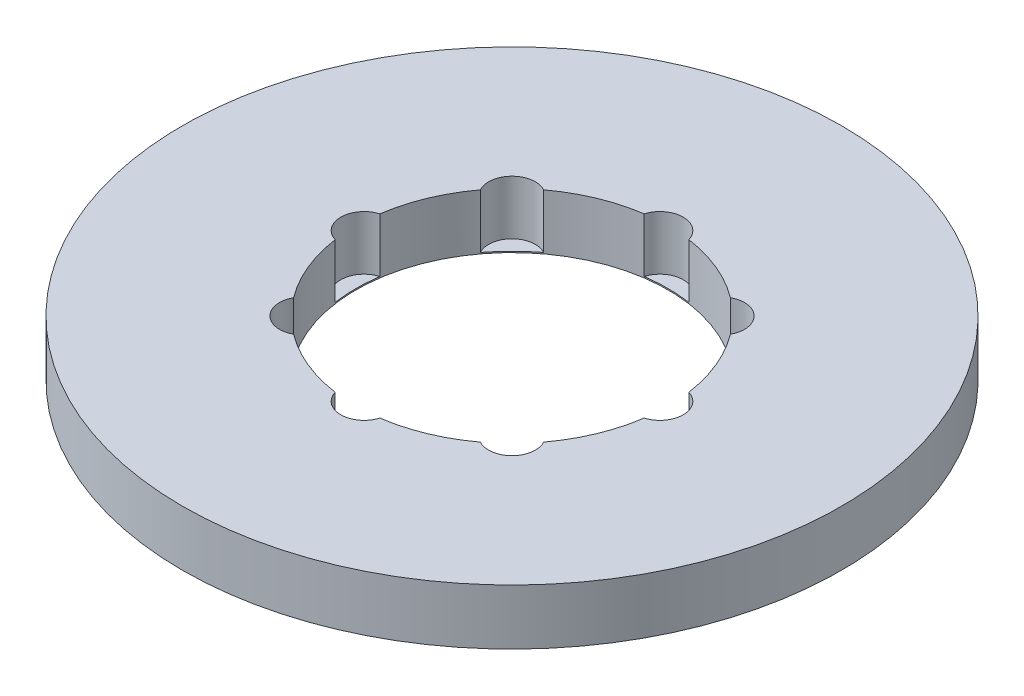
ISO-10303-21;
HEADER;
FILE_DESCRIPTION(('STEP AP214'),'2;1');
FILE_NAME('part.step','',(''),(''),'','','');
FILE_SCHEMA(('AUTOMOTIVE_DESIGN { 1 0 10303 214 1 1 1 1 }'));
ENDSEC;
DATA;
#1=APPLICATION_CONTEXT('core data for automotive mechanical design processes');
#2=APPLICATION_PROTOCOL_DEFINITION('international standard','automotive_design',2000,#1);
#3=PRODUCT_CONTEXT('',#1,'mechanical');
#4=PRODUCT('Part','Part','',(#3));
#5=PRODUCT_RELATED_PRODUCT_CATEGORY('part','',(#4));
#6=PRODUCT_DEFINITION_FORMATION('','',#4);
#7=PRODUCT_DEFINITION_CONTEXT('part definition',#1,'design');
#8=PRODUCT_DEFINITION('design','',#6,#7);
#9=PRODUCT_DEFINITION_SHAPE('','',#8);
#10=(LENGTH_UNIT() NAMED_UNIT(*) SI_UNIT(.MILLI.,.METRE.));
#11=(NAMED_UNIT(*) PLANE_ANGLE_UNIT() SI_UNIT($,.RADIAN.));
#12=(NAMED_UNIT(*) SI_UNIT($,.STERADIAN.) SOLID_ANGLE_UNIT());
#13=UNCERTAINTY_MEASURE_WITH_UNIT(LENGTH_MEASURE(1.E-05),#10,'distance_accuracy_value','');
#14=(GEOMETRIC_REPRESENTATION_CONTEXT(3) GLOBAL_UNCERTAINTY_ASSIGNED_CONTEXT((#13)) GLOBAL_UNIT_ASSIGNED_CONTEXT((#10,
#11,#12)) REPRESENTATION_CONTEXT('',''));
#15=CARTESIAN_POINT('',(0.,0.,0.));
#16=DIRECTION('',(0.,0.,1.));
#17=DIRECTION('',(1.,0.,0.));
#18=AXIS2_PLACEMENT_3D('',#15,#16,#17);
#19=CARTESIAN_POINT('',(0.,16.,0.));
#20=DIRECTION('',(0.,-1.,0.));
#21=DIRECTION('',(0.,0.,-1.));
#22=AXIS2_PLACEMENT_3D('',#19,#20,#21);
#23=CYLINDRICAL_SURFACE('',#22,95.);
#24=CARTESIAN_POINT('',(0.,16.,0.));
#25=DIRECTION('',(0.,1.,0.));
#26=DIRECTION('',(0.,0.,1.));
#27=AXIS2_PLACEMENT_3D('',#24,#25,#26);
#28=CIRCLE('',#27,95.);
#29=CARTESIAN_POINT('',(0.,16.,95.));
#30=VERTEX_POINT('',#29);
#31=EDGE_CURVE('E183',#30,#30,#28,.T.);
#32=ORIENTED_EDGE('',*,*,#31,.F.);
#33=EDGE_LOOP('',(#32));
#34=FACE_BOUND('',#33,.T.);
#35=CARTESIAN_POINT('',(0.,0.,0.));
#36=DIRECTION('',(0.,1.,0.));
#37=DIRECTION('',(0.,0.,1.));
#38=AXIS2_PLACEMENT_3D('',#35,#36,#37);
#39=CIRCLE('',#38,95.);
#40=CARTESIAN_POINT('',(0.,0.,95.));
#41=VERTEX_POINT('',#40);
#42=EDGE_CURVE('E182',#41,#41,#39,.T.);
#43=ORIENTED_EDGE('',*,*,#42,.T.);
#44=EDGE_LOOP('',(#43));
#45=FACE_BOUND('',#44,.T.);
#46=ADVANCED_FACE('F39',(#34,#45),#23,.T.);
#47=CARTESIAN_POINT('',(0.,16.,0.));
#48=DIRECTION('',(0.,1.,0.));
#49=DIRECTION('',(0.,0.,1.));
#50=AXIS2_PLACEMENT_3D('',#47,#48,#49);
#51=PLANE('',#50);
#52=CARTESIAN_POINT('',(1.48870215639707E-13,16.,42.638124392506));
#53=DIRECTION('',(0.,1.,0.));
#54=DIRECTION('',(1.,0.,0.));
#55=AXIS2_PLACEMENT_3D('',#52,#53,#54);
#56=CIRCLE('',#55,6.71547705988087);
#57=CARTESIAN_POINT('',(-6.44154630315603,16.,44.536574646287));
#58=VERTEX_POINT('',#57);
#59=CARTESIAN_POINT('',(6.44154630315634,16.,44.536574646287));
#60=VERTEX_POINT('',#59);
#61=EDGE_CURVE('E256',#58,#60,#56,.T.);
#62=ORIENTED_EDGE('',*,*,#61,.F.);
#63=CARTESIAN_POINT('',(0.,16.,0.));
#64=DIRECTION('',(0.,1.,0.));
#65=DIRECTION('',(0.,0.,1.));
#66=AXIS2_PLACEMENT_3D('',#63,#64,#65);
#67=CIRCLE('',#66,45.);
#68=CARTESIAN_POINT('',(-26.9372528709215,16.,36.0469750154993));
#69=VERTEX_POINT('',#68);
#70=EDGE_CURVE('E175',#69,#58,#67,.T.);
#71=ORIENTED_EDGE('',*,*,#70,.F.);
#72=CARTESIAN_POINT('',(-30.1497068950165,16.,30.1497068950166));
#73=DIRECTION('',(0.,1.,0.));
#74=DIRECTION('',(0.707106781186549,0.,0.707106781186546));
#75=AXIS2_PLACEMENT_3D('',#72,#73,#74);
#76=CIRCLE('',#75,6.71547705988087);
#77=CARTESIAN_POINT('',(-36.0469750154992,16.,26.9372528709216));
#78=VERTEX_POINT('',#77);
#79=EDGE_CURVE('E152',#78,#69,#76,.T.);
#80=ORIENTED_EDGE('',*,*,#79,.F.);
#81=CARTESIAN_POINT('',(-44.536574646287,16.,6.44154630315619));
#82=VERTEX_POINT('',#81);
#83=EDGE_CURVE('E168',#82,#78,#67,.T.);
#84=ORIENTED_EDGE('',*,*,#83,.F.);
#85=CARTESIAN_POINT('',(-42.638124392506,16.,0.));
#86=DIRECTION('',(0.,1.,0.));
#87=DIRECTION('',(0.,0.,1.));
#88=AXIS2_PLACEMENT_3D('',#85,#86,#87);
#89=CIRCLE('',#88,6.71547705988087);
#90=CARTESIAN_POINT('',(-44.536574646287,16.,-6.44154630315619));
#91=VERTEX_POINT('',#90);
#92=EDGE_CURVE('E205',#91,#82,#89,.T.);
#93=ORIENTED_EDGE('',*,*,#92,.F.);
#94=CARTESIAN_POINT('',(-36.0469750154996,16.,-26.9372528709211));
#95=VERTEX_POINT('',#94);
#96=EDGE_CURVE('E181',#95,#91,#67,.T.);
#97=ORIENTED_EDGE('',*,*,#96,.F.);
#98=CARTESIAN_POINT('',(-30.1497068950169,16.,-30.1497068950162));
#99=DIRECTION('',(0.,1.,0.));
#100=DIRECTION('',(-0.707106781186539,0.,0.707106781186556));
#101=AXIS2_PLACEMENT_3D('',#98,#99,#100);
#102=CIRCLE('',#101,6.71547705988087);
#103=CARTESIAN_POINT('',(-26.937252870922,16.,-36.046975015499));
#104=VERTEX_POINT('',#103);
#105=EDGE_CURVE('E453',#104,#95,#102,.T.);
#106=ORIENTED_EDGE('',*,*,#105,.F.);
#107=CARTESIAN_POINT('',(-6.44154630315666,16.,-44.536574646287));
#108=VERTEX_POINT('',#107);
#109=EDGE_CURVE('E189',#108,#104,#67,.T.);
#110=ORIENTED_EDGE('',*,*,#109,.F.);
#111=CARTESIAN_POINT('',(-4.46610646919121E-13,16.,-42.638124392506));
#112=DIRECTION('',(0.,1.,0.));
#113=DIRECTION('',(-1.,0.,0.));
#114=AXIS2_PLACEMENT_3D('',#111,#112,#113);
#115=CIRCLE('',#114,6.71547705988087);
#116=CARTESIAN_POINT('',(6.44154630315572,16.,-44.5365746462871));
#117=VERTEX_POINT('',#116);
#118=EDGE_CURVE('E462',#117,#108,#115,.T.);
#119=ORIENTED_EDGE('',*,*,#118,.F.);
#120=CARTESIAN_POINT('',(26.9372528709212,16.,-36.0469750154995));
#121=VERTEX_POINT('',#120);
#122=EDGE_CURVE('E197',#121,#117,#67,.T.);
#123=ORIENTED_EDGE('',*,*,#122,.F.);
#124=CARTESIAN_POINT('',(30.1497068950163,16.,-30.1497068950168));
#125=DIRECTION('',(0.,1.,0.));
#126=DIRECTION('',(-0.707106781186554,0.,-0.707106781186541));
#127=AXIS2_PLACEMENT_3D('',#124,#125,#126);
#128=CIRCLE('',#127,6.71547705988087);
#129=CARTESIAN_POINT('',(36.0469750154991,16.,-26.9372528709218));
#130=VERTEX_POINT('',#129);
#131=EDGE_CURVE('E470',#130,#121,#128,.T.);
#132=ORIENTED_EDGE('',*,*,#131,.F.);
#133=CARTESIAN_POINT('',(44.536574646287,16.,-6.44154630315619));
#134=VERTEX_POINT('',#133);
#135=EDGE_CURVE('E489',#134,#130,#67,.T.);
#136=ORIENTED_EDGE('',*,*,#135,.F.);
#137=CARTESIAN_POINT('',(42.638124392506,16.,0.));
#138=DIRECTION('',(0.,1.,0.));
#139=DIRECTION('',(0.,0.,-1.));
#140=AXIS2_PLACEMENT_3D('',#137,#138,#139);
#141=CIRCLE('',#140,6.71547705988087);
#142=CARTESIAN_POINT('',(44.536574646287,16.,6.44154630315619));
#143=VERTEX_POINT('',#142);
#144=EDGE_CURVE('E476',#143,#134,#141,.T.);
#145=ORIENTED_EDGE('',*,*,#144,.F.);
#146=CARTESIAN_POINT('',(36.0469750154994,16.,26.9372528709214));
#147=VERTEX_POINT('',#146);
#148=EDGE_CURVE('E491',#147,#143,#67,.T.);
#149=ORIENTED_EDGE('',*,*,#148,.F.);
#150=CARTESIAN_POINT('',(30.1497068950167,16.,30.1497068950164));
#151=DIRECTION('',(0.,1.,0.));
#152=DIRECTION('',(0.707106781186544,0.,-0.707106781186551));
#153=AXIS2_PLACEMENT_3D('',#150,#151,#152);
#154=CIRCLE('',#153,6.71547705988087);
#155=CARTESIAN_POINT('',(26.9372528709217,16.,36.0469750154992));
#156=VERTEX_POINT('',#155);
#157=EDGE_CURVE('E475',#156,#147,#154,.T.);
#158=ORIENTED_EDGE('',*,*,#157,.F.);
#159=EDGE_CURVE('E190',#60,#156,#67,.T.);
#160=ORIENTED_EDGE('',*,*,#159,.F.);
#161=EDGE_LOOP('',(#62,#71,#80,#84,#93,#97,#106,#110,#119,#123,#132,#136,#145,#149,#158,#160));
#162=FACE_BOUND('',#161,.T.);
#163=ORIENTED_EDGE('',*,*,#31,.T.);
#164=EDGE_LOOP('',(#163));
#165=FACE_BOUND('',#164,.T.);
#166=ADVANCED_FACE('F170',(#162,#165),#51,.T.);
#167=CARTESIAN_POINT('',(0.,0.,0.));
#168=DIRECTION('',(0.,1.,0.));
#169=DIRECTION('',(0.,0.,1.));
#170=AXIS2_PLACEMENT_3D('',#167,#168,#169);
#171=PLANE('',#170);
#172=CARTESIAN_POINT('',(0.,0.,0.));
#173=DIRECTION('',(0.,1.,0.));
#174=DIRECTION('',(0.,0.,1.));
#175=AXIS2_PLACEMENT_3D('',#172,#173,#174);
#176=CIRCLE('',#175,45.);
#177=CARTESIAN_POINT('',(0.,0.,45.));
#178=VERTEX_POINT('',#177);
#179=EDGE_CURVE('E191',#178,#178,#176,.T.);
#180=ORIENTED_EDGE('',*,*,#179,.T.);
#181=EDGE_LOOP('',(#180));
#182=FACE_BOUND('',#181,.T.);
#183=ORIENTED_EDGE('',*,*,#42,.F.);
#184=EDGE_LOOP('',(#183));
#185=FACE_BOUND('',#184,.T.);
#186=ADVANCED_FACE('F277',(#182,#185),#171,.F.);
#187=CARTESIAN_POINT('',(0.,16.,0.));
#188=DIRECTION('',(0.,-1.,0.));
#189=DIRECTION('',(0.,0.,-1.));
#190=AXIS2_PLACEMENT_3D('',#187,#188,#189);
#191=CYLINDRICAL_SURFACE('',#190,45.);
#192=DIRECTION('',(0.,1.,0.));
#193=VECTOR('',#192,1.);
#194=CARTESIAN_POINT('',(-6.44154630315603,8.18353095102684,44.5365746462871));
#195=LINE('',#194,#193);
#196=CARTESIAN_POINT('',(-6.44154630315603,0.36706190205368,44.536574646287));
#197=VERTEX_POINT('',#196);
#198=EDGE_CURVE('E11',#197,#58,#195,.T.);
#199=ORIENTED_EDGE('',*,*,#198,.F.);
#200=CARTESIAN_POINT('',(0.,0.36706190205368,0.));
#201=DIRECTION('',(0.,1.,0.));
#202=DIRECTION('',(0.,0.,1.));
#203=AXIS2_PLACEMENT_3D('',#200,#201,#202);
#204=CIRCLE('',#203,45.);
#205=CARTESIAN_POINT('',(6.44154630315634,0.36706190205368,44.536574646287));
#206=VERTEX_POINT('',#205);
#207=EDGE_CURVE('E251',#197,#206,#204,.T.);
#208=ORIENTED_EDGE('',*,*,#207,.T.);
#209=DIRECTION('',(0.,1.,0.));
#210=VECTOR('',#209,1.);
#211=CARTESIAN_POINT('',(6.44154630315634,8.18353095102684,44.536574646287));
#212=LINE('',#211,#210);
#213=EDGE_CURVE('E46',#60,#206,#212,.F.);
#214=ORIENTED_EDGE('',*,*,#213,.F.);
#215=ORIENTED_EDGE('',*,*,#159,.T.);
#216=DIRECTION('',(0.,1.,0.));
#217=VECTOR('',#216,1.);
#218=CARTESIAN_POINT('',(26.9372528709217,8.18353095102684,36.0469750154992));
#219=LINE('',#218,#217);
#220=CARTESIAN_POINT('',(26.9372528709217,0.36706190205368,36.0469750154992));
#221=VERTEX_POINT('',#220);
#222=EDGE_CURVE('E253',#221,#156,#219,.T.);
#223=ORIENTED_EDGE('',*,*,#222,.F.);
#224=CARTESIAN_POINT('',(0.,0.36706190205368,0.));
#225=DIRECTION('',(0.,1.,0.));
#226=DIRECTION('',(0.,0.,1.));
#227=AXIS2_PLACEMENT_3D('',#224,#225,#226);
#228=CIRCLE('',#227,45.);
#229=CARTESIAN_POINT('',(36.0469750154994,0.36706190205368,26.9372528709214));
#230=VERTEX_POINT('',#229);
#231=EDGE_CURVE('E246',#221,#230,#228,.T.);
#232=ORIENTED_EDGE('',*,*,#231,.T.);
#233=DIRECTION('',(0.,1.,0.));
#234=VECTOR('',#233,1.);
#235=CARTESIAN_POINT('',(36.0469750154994,8.18353095102684,26.9372528709214));
#236=LINE('',#235,#234);
#237=EDGE_CURVE('E248',#147,#230,#236,.F.);
#238=ORIENTED_EDGE('',*,*,#237,.F.);
#239=ORIENTED_EDGE('',*,*,#148,.T.);
#240=DIRECTION('',(0.,1.,0.));
#241=VECTOR('',#240,1.);
#242=CARTESIAN_POINT('',(44.536574646287,8.18353095102684,6.44154630315619));
#243=LINE('',#242,#241);
#244=CARTESIAN_POINT('',(44.536574646287,0.36706190205368,6.44154630315619));
#245=VERTEX_POINT('',#244);
#246=EDGE_CURVE('E243',#245,#143,#243,.T.);
#247=ORIENTED_EDGE('',*,*,#246,.F.);
#248=CARTESIAN_POINT('',(0.,0.36706190205368,0.));
#249=DIRECTION('',(0.,1.,0.));
#250=DIRECTION('',(0.,0.,1.));
#251=AXIS2_PLACEMENT_3D('',#248,#249,#250);
#252=CIRCLE('',#251,45.);
#253=CARTESIAN_POINT('',(44.536574646287,0.36706190205368,-6.44154630315619));
#254=VERTEX_POINT('',#253);
#255=EDGE_CURVE('E236',#245,#254,#252,.T.);
#256=ORIENTED_EDGE('',*,*,#255,.T.);
#257=DIRECTION('',(0.,1.,0.));
#258=VECTOR('',#257,1.);
#259=CARTESIAN_POINT('',(44.536574646287,8.18353095102684,-6.44154630315619));
#260=LINE('',#259,#258);
#261=EDGE_CURVE('E241',#134,#254,#260,.F.);
#262=ORIENTED_EDGE('',*,*,#261,.F.);
#263=ORIENTED_EDGE('',*,*,#135,.T.);
#264=DIRECTION('',(0.,1.,0.));
#265=VECTOR('',#264,1.);
#266=CARTESIAN_POINT('',(36.0469750154991,8.18353095102684,-26.9372528709219));
#267=LINE('',#266,#265);
#268=CARTESIAN_POINT('',(36.0469750154991,0.36706190205368,-26.9372528709218));
#269=VERTEX_POINT('',#268);
#270=EDGE_CURVE('E237',#269,#130,#267,.T.);
#271=ORIENTED_EDGE('',*,*,#270,.F.);
#272=CARTESIAN_POINT('',(0.,0.36706190205368,0.));
#273=DIRECTION('',(0.,1.,0.));
#274=DIRECTION('',(0.,0.,1.));
#275=AXIS2_PLACEMENT_3D('',#272,#273,#274);
#276=CIRCLE('',#275,45.);
#277=CARTESIAN_POINT('',(26.9372528709212,0.36706190205368,-36.0469750154995));
#278=VERTEX_POINT('',#277);
#279=EDGE_CURVE('E229',#269,#278,#276,.T.);
#280=ORIENTED_EDGE('',*,*,#279,.T.);
#281=DIRECTION('',(0.,1.,0.));
#282=VECTOR('',#281,1.);
#283=CARTESIAN_POINT('',(26.9372528709212,8.18353095102684,-36.0469750154995));
#284=LINE('',#283,#282);
#285=EDGE_CURVE('E232',#121,#278,#284,.F.);
#286=ORIENTED_EDGE('',*,*,#285,.F.);
#287=ORIENTED_EDGE('',*,*,#122,.T.);
#288=DIRECTION('',(0.,1.,0.));
#289=VECTOR('',#288,1.);
#290=CARTESIAN_POINT('',(6.44154630315572,8.18353095102684,-44.5365746462871));
#291=LINE('',#290,#289);
#292=CARTESIAN_POINT('',(6.44154630315572,0.36706190205368,-44.5365746462871));
#293=VERTEX_POINT('',#292);
#294=EDGE_CURVE('E227',#293,#117,#291,.T.);
#295=ORIENTED_EDGE('',*,*,#294,.F.);
#296=CARTESIAN_POINT('',(0.,0.36706190205368,0.));
#297=DIRECTION('',(0.,1.,0.));
#298=DIRECTION('',(0.,0.,1.));
#299=AXIS2_PLACEMENT_3D('',#296,#297,#298);
#300=CIRCLE('',#299,45.);
#301=CARTESIAN_POINT('',(-6.44154630315666,0.36706190205368,-44.536574646287));
#302=VERTEX_POINT('',#301);
#303=EDGE_CURVE('E225',#293,#302,#300,.T.);
#304=ORIENTED_EDGE('',*,*,#303,.T.);
#305=DIRECTION('',(0.,1.,0.));
#306=VECTOR('',#305,1.);
#307=CARTESIAN_POINT('',(-6.44154630315665,8.18353095102684,-44.536574646287));
#308=LINE('',#307,#306);
#309=EDGE_CURVE('E223',#108,#302,#308,.F.);
#310=ORIENTED_EDGE('',*,*,#309,.F.);
#311=ORIENTED_EDGE('',*,*,#109,.T.);
#312=DIRECTION('',(0.,1.,0.));
#313=VECTOR('',#312,1.);
#314=CARTESIAN_POINT('',(-26.937252870922,8.18353095102684,-36.046975015499));
#315=LINE('',#314,#313);
#316=CARTESIAN_POINT('',(-26.937252870922,0.36706190205368,-36.046975015499));
#317=VERTEX_POINT('',#316);
#318=EDGE_CURVE('E219',#317,#104,#315,.T.);
#319=ORIENTED_EDGE('',*,*,#318,.F.);
#320=CARTESIAN_POINT('',(0.,0.36706190205368,0.));
#321=DIRECTION('',(0.,1.,0.));
#322=DIRECTION('',(0.,0.,1.));
#323=AXIS2_PLACEMENT_3D('',#320,#321,#322);
#324=CIRCLE('',#323,45.);
#325=CARTESIAN_POINT('',(-36.0469750154996,0.36706190205368,-26.9372528709211));
#326=VERTEX_POINT('',#325);
#327=EDGE_CURVE('E159',#317,#326,#324,.T.);
#328=ORIENTED_EDGE('',*,*,#327,.T.);
#329=DIRECTION('',(0.,1.,0.));
#330=VECTOR('',#329,1.);
#331=CARTESIAN_POINT('',(-36.0469750154996,8.18353095102684,-26.9372528709211));
#332=LINE('',#331,#330);
#333=EDGE_CURVE('E220',#95,#326,#332,.F.);
#334=ORIENTED_EDGE('',*,*,#333,.F.);
#335=ORIENTED_EDGE('',*,*,#96,.T.);
#336=DIRECTION('',(0.,1.,0.));
#337=VECTOR('',#336,1.);
#338=CARTESIAN_POINT('',(-44.536574646287,8.18353095102684,-6.44154630315619));
#339=LINE('',#338,#337);
#340=CARTESIAN_POINT('',(-44.536574646287,0.36706190205368,-6.44154630315619));
#341=VERTEX_POINT('',#340);
#342=EDGE_CURVE('E209',#341,#91,#339,.T.);
#343=ORIENTED_EDGE('',*,*,#342,.F.);
#344=CARTESIAN_POINT('',(0.,0.36706190205368,0.));
#345=DIRECTION('',(0.,1.,0.));
#346=DIRECTION('',(0.,0.,1.));
#347=AXIS2_PLACEMENT_3D('',#344,#345,#346);
#348=CIRCLE('',#347,45.);
#349=CARTESIAN_POINT('',(-44.536574646287,0.36706190205368,6.44154630315619));
#350=VERTEX_POINT('',#349);
#351=EDGE_CURVE('E206',#341,#350,#348,.T.);
#352=ORIENTED_EDGE('',*,*,#351,.T.);
#353=DIRECTION('',(0.,1.,0.));
#354=VECTOR('',#353,1.);
#355=CARTESIAN_POINT('',(-44.536574646287,8.18353095102684,6.44154630315619));
#356=LINE('',#355,#354);
#357=EDGE_CURVE('E179',#82,#350,#356,.F.);
#358=ORIENTED_EDGE('',*,*,#357,.F.);
#359=ORIENTED_EDGE('',*,*,#83,.T.);
#360=DIRECTION('',(0.,1.,0.));
#361=VECTOR('',#360,1.);
#362=CARTESIAN_POINT('',(-36.0469750154992,8.18353095102684,26.9372528709216));
#363=LINE('',#362,#361);
#364=CARTESIAN_POINT('',(-36.0469750154992,0.36706190205368,26.9372528709216));
#365=VERTEX_POINT('',#364);
#366=EDGE_CURVE('E147',#365,#78,#363,.T.);
#367=ORIENTED_EDGE('',*,*,#366,.F.);
#368=CARTESIAN_POINT('',(0.,0.36706190205368,0.));
#369=DIRECTION('',(0.,1.,0.));
#370=DIRECTION('',(0.,0.,1.));
#371=AXIS2_PLACEMENT_3D('',#368,#369,#370);
#372=CIRCLE('',#371,45.);
#373=CARTESIAN_POINT('',(-26.9372528709215,0.36706190205368,36.0469750154993));
#374=VERTEX_POINT('',#373);
#375=EDGE_CURVE('E215',#365,#374,#372,.T.);
#376=ORIENTED_EDGE('',*,*,#375,.T.);
#377=DIRECTION('',(0.,1.,0.));
#378=VECTOR('',#377,1.);
#379=CARTESIAN_POINT('',(-26.9372528709215,8.18353095102684,36.0469750154993));
#380=LINE('',#379,#378);
#381=EDGE_CURVE('E161',#69,#374,#380,.F.);
#382=ORIENTED_EDGE('',*,*,#381,.F.);
#383=ORIENTED_EDGE('',*,*,#70,.T.);
#384=EDGE_LOOP('',(#199,#208,#214,#215,#223,#232,#238,#239,#247,#256,#262,#263,#271,#280,#286,
#287,#295,#304,#310,#311,#319,#328,#334,#335,#343,#352,#358,#359,#367,#376,#382,#383));
#385=FACE_BOUND('',#384,.T.);
#386=ORIENTED_EDGE('',*,*,#179,.F.);
#387=EDGE_LOOP('',(#386));
#388=FACE_BOUND('',#387,.T.);
#389=ADVANCED_FACE('F176',(#385,#388),#191,.F.);
#390=CARTESIAN_POINT('',(-42.638124392506,0.36706190205368,0.));
#391=DIRECTION('',(0.,1.,0.));
#392=DIRECTION('',(0.,0.,1.));
#393=AXIS2_PLACEMENT_3D('',#390,#391,#392);
#394=CYLINDRICAL_SURFACE('',#393,6.71547705988087);
#395=ORIENTED_EDGE('',*,*,#342,.T.);
#396=ORIENTED_EDGE('',*,*,#92,.T.);
#397=ORIENTED_EDGE('',*,*,#357,.T.);
#398=CARTESIAN_POINT('',(-42.638124392506,0.36706190205368,0.));
#399=DIRECTION('',(0.,1.,0.));
#400=DIRECTION('',(0.,0.,1.));
#401=AXIS2_PLACEMENT_3D('',#398,#399,#400);
#402=CIRCLE('',#401,6.71547705988087);
#403=EDGE_CURVE('E200',#341,#350,#402,.T.);
#404=ORIENTED_EDGE('',*,*,#403,.F.);
#405=EDGE_LOOP('',(#395,#396,#397,#404));
#406=FACE_BOUND('',#405,.T.);
#407=ADVANCED_FACE('F286',(#406),#394,.F.);
#408=CARTESIAN_POINT('',(-42.638124392506,0.36706190205368,0.));
#409=DIRECTION('',(0.,1.,0.));
#410=DIRECTION('',(0.,0.,1.));
#411=AXIS2_PLACEMENT_3D('',#408,#409,#410);
#412=PLANE('',#411);
#413=ORIENTED_EDGE('',*,*,#403,.T.);
#414=ORIENTED_EDGE('',*,*,#351,.F.);
#415=EDGE_LOOP('',(#413,#414));
#416=FACE_BOUND('',#415,.T.);
#417=ADVANCED_FACE('F289',(#416),#412,.T.);
#418=CARTESIAN_POINT('',(-30.1497068950165,0.36706190205368,30.1497068950166));
#419=DIRECTION('',(0.,1.,0.));
#420=DIRECTION('',(0.,0.,1.));
#421=AXIS2_PLACEMENT_3D('',#418,#419,#420);
#422=CYLINDRICAL_SURFACE('',#421,6.71547705988087);
#423=ORIENTED_EDGE('',*,*,#366,.T.);
#424=ORIENTED_EDGE('',*,*,#79,.T.);
#425=ORIENTED_EDGE('',*,*,#381,.T.);
#426=CARTESIAN_POINT('',(-30.1497068950165,0.36706190205368,30.1497068950166));
#427=DIRECTION('',(0.,1.,0.));
#428=DIRECTION('',(0.707106781186549,0.,0.707106781186546));
#429=AXIS2_PLACEMENT_3D('',#426,#427,#428);
#430=CIRCLE('',#429,6.71547705988087);
#431=EDGE_CURVE('E156',#365,#374,#430,.T.);
#432=ORIENTED_EDGE('',*,*,#431,.F.);
#433=EDGE_LOOP('',(#423,#424,#425,#432));
#434=FACE_BOUND('',#433,.T.);
#435=ADVANCED_FACE('F155',(#434),#422,.F.);
#436=CARTESIAN_POINT('',(-30.1497068950165,0.36706190205368,30.1497068950166));
#437=DIRECTION('',(0.,1.,0.));
#438=DIRECTION('',(0.707106781186549,0.,0.707106781186546));
#439=AXIS2_PLACEMENT_3D('',#436,#437,#438);
#440=PLANE('',#439);
#441=ORIENTED_EDGE('',*,*,#431,.T.);
#442=ORIENTED_EDGE('',*,*,#375,.F.);
#443=EDGE_LOOP('',(#441,#442));
#444=FACE_BOUND('',#443,.T.);
#445=ADVANCED_FACE('F300',(#444),#440,.T.);
#446=CARTESIAN_POINT('',(-30.1497068950169,0.36706190205368,-30.1497068950162));
#447=DIRECTION('',(0.,1.,0.));
#448=DIRECTION('',(0.,0.,1.));
#449=AXIS2_PLACEMENT_3D('',#446,#447,#448);
#450=CYLINDRICAL_SURFACE('',#449,6.71547705988087);
#451=ORIENTED_EDGE('',*,*,#318,.T.);
#452=ORIENTED_EDGE('',*,*,#105,.T.);
#453=ORIENTED_EDGE('',*,*,#333,.T.);
#454=CARTESIAN_POINT('',(-30.1497068950169,0.36706190205368,-30.1497068950162));
#455=DIRECTION('',(0.,1.,0.));
#456=DIRECTION('',(-0.707106781186539,0.,0.707106781186556));
#457=AXIS2_PLACEMENT_3D('',#454,#455,#456);
#458=CIRCLE('',#457,6.71547705988087);
#459=EDGE_CURVE('E454',#317,#326,#458,.T.);
#460=ORIENTED_EDGE('',*,*,#459,.F.);
#461=EDGE_LOOP('',(#451,#452,#453,#460));
#462=FACE_BOUND('',#461,.T.);
#463=ADVANCED_FACE('F299',(#462),#450,.F.);
#464=CARTESIAN_POINT('',(-30.1497068950169,0.36706190205368,-30.1497068950162));
#465=DIRECTION('',(0.,1.,0.));
#466=DIRECTION('',(-0.707106781186539,0.,0.707106781186556));
#467=AXIS2_PLACEMENT_3D('',#464,#465,#466);
#468=PLANE('',#467);
#469=ORIENTED_EDGE('',*,*,#459,.T.);
#470=ORIENTED_EDGE('',*,*,#327,.F.);
#471=EDGE_LOOP('',(#469,#470));
#472=FACE_BOUND('',#471,.T.);
#473=ADVANCED_FACE('F379',(#472),#468,.T.);
#474=CARTESIAN_POINT('',(-4.46610646919121E-13,0.36706190205368,-42.638124392506));
#475=DIRECTION('',(0.,1.,0.));
#476=DIRECTION('',(0.,0.,1.));
#477=AXIS2_PLACEMENT_3D('',#474,#475,#476);
#478=CYLINDRICAL_SURFACE('',#477,6.71547705988087);
#479=ORIENTED_EDGE('',*,*,#294,.T.);
#480=ORIENTED_EDGE('',*,*,#118,.T.);
#481=ORIENTED_EDGE('',*,*,#309,.T.);
#482=CARTESIAN_POINT('',(-4.46610646919121E-13,0.36706190205368,-42.638124392506));
#483=DIRECTION('',(0.,1.,0.));
#484=DIRECTION('',(-1.,0.,0.));
#485=AXIS2_PLACEMENT_3D('',#482,#483,#484);
#486=CIRCLE('',#485,6.71547705988087);
#487=EDGE_CURVE('E465',#293,#302,#486,.T.);
#488=ORIENTED_EDGE('',*,*,#487,.F.);
#489=EDGE_LOOP('',(#479,#480,#481,#488));
#490=FACE_BOUND('',#489,.T.);
#491=ADVANCED_FACE('F371',(#490),#478,.F.);
#492=CARTESIAN_POINT('',(-4.46610646919121E-13,0.36706190205368,-42.638124392506));
#493=DIRECTION('',(0.,1.,0.));
#494=DIRECTION('',(-1.,0.,0.));
#495=AXIS2_PLACEMENT_3D('',#492,#493,#494);
#496=PLANE('',#495);
#497=ORIENTED_EDGE('',*,*,#487,.T.);
#498=ORIENTED_EDGE('',*,*,#303,.F.);
#499=EDGE_LOOP('',(#497,#498));
#500=FACE_BOUND('',#499,.T.);
#501=ADVANCED_FACE('F308',(#500),#496,.T.);
#502=CARTESIAN_POINT('',(30.1497068950163,0.36706190205368,-30.1497068950168));
#503=DIRECTION('',(0.,1.,0.));
#504=DIRECTION('',(0.,0.,1.));
#505=AXIS2_PLACEMENT_3D('',#502,#503,#504);
#506=CYLINDRICAL_SURFACE('',#505,6.71547705988087);
#507=ORIENTED_EDGE('',*,*,#270,.T.);
#508=ORIENTED_EDGE('',*,*,#131,.T.);
#509=ORIENTED_EDGE('',*,*,#285,.T.);
#510=CARTESIAN_POINT('',(30.1497068950163,0.36706190205368,-30.1497068950168));
#511=DIRECTION('',(0.,1.,0.));
#512=DIRECTION('',(-0.707106781186554,0.,-0.707106781186541));
#513=AXIS2_PLACEMENT_3D('',#510,#511,#512);
#514=CIRCLE('',#513,6.71547705988087);
#515=EDGE_CURVE('E477',#269,#278,#514,.T.);
#516=ORIENTED_EDGE('',*,*,#515,.F.);
#517=EDGE_LOOP('',(#507,#508,#509,#516));
#518=FACE_BOUND('',#517,.T.);
#519=ADVANCED_FACE('F305',(#518),#506,.F.);
#520=CARTESIAN_POINT('',(30.1497068950163,0.36706190205368,-30.1497068950168));
#521=DIRECTION('',(0.,1.,0.));
#522=DIRECTION('',(-0.707106781186554,0.,-0.707106781186541));
#523=AXIS2_PLACEMENT_3D('',#520,#521,#522);
#524=PLANE('',#523);
#525=ORIENTED_EDGE('',*,*,#515,.T.);
#526=ORIENTED_EDGE('',*,*,#279,.F.);
#527=EDGE_LOOP('',(#525,#526));
#528=FACE_BOUND('',#527,.T.);
#529=ADVANCED_FACE('F304',(#528),#524,.T.);
#530=CARTESIAN_POINT('',(42.638124392506,0.36706190205368,0.));
#531=DIRECTION('',(0.,1.,0.));
#532=DIRECTION('',(0.,0.,1.));
#533=AXIS2_PLACEMENT_3D('',#530,#531,#532);
#534=CYLINDRICAL_SURFACE('',#533,6.71547705988087);
#535=ORIENTED_EDGE('',*,*,#246,.T.);
#536=ORIENTED_EDGE('',*,*,#144,.T.);
#537=ORIENTED_EDGE('',*,*,#261,.T.);
#538=CARTESIAN_POINT('',(42.638124392506,0.36706190205368,0.));
#539=DIRECTION('',(0.,1.,0.));
#540=DIRECTION('',(0.,0.,-1.));
#541=AXIS2_PLACEMENT_3D('',#538,#539,#540);
#542=CIRCLE('',#541,6.71547705988087);
#543=EDGE_CURVE('E478',#245,#254,#542,.T.);
#544=ORIENTED_EDGE('',*,*,#543,.F.);
#545=EDGE_LOOP('',(#535,#536,#537,#544));
#546=FACE_BOUND('',#545,.T.);
#547=ADVANCED_FACE('F309',(#546),#534,.F.);
#548=CARTESIAN_POINT('',(42.638124392506,0.36706190205368,0.));
#549=DIRECTION('',(0.,1.,0.));
#550=DIRECTION('',(0.,0.,-1.));
#551=AXIS2_PLACEMENT_3D('',#548,#549,#550);
#552=PLANE('',#551);
#553=ORIENTED_EDGE('',*,*,#543,.T.);
#554=ORIENTED_EDGE('',*,*,#255,.F.);
#555=EDGE_LOOP('',(#553,#554));
#556=FACE_BOUND('',#555,.T.);
#557=ADVANCED_FACE('F314',(#556),#552,.T.);
#558=CARTESIAN_POINT('',(30.1497068950167,0.36706190205368,30.1497068950164));
#559=DIRECTION('',(0.,1.,0.));
#560=DIRECTION('',(0.,0.,1.));
#561=AXIS2_PLACEMENT_3D('',#558,#559,#560);
#562=CYLINDRICAL_SURFACE('',#561,6.71547705988087);
#563=ORIENTED_EDGE('',*,*,#222,.T.);
#564=ORIENTED_EDGE('',*,*,#157,.T.);
#565=ORIENTED_EDGE('',*,*,#237,.T.);
#566=CARTESIAN_POINT('',(30.1497068950167,0.36706190205368,30.1497068950164));
#567=DIRECTION('',(0.,1.,0.));
#568=DIRECTION('',(0.707106781186544,0.,-0.707106781186551));
#569=AXIS2_PLACEMENT_3D('',#566,#567,#568);
#570=CIRCLE('',#569,6.71547705988087);
#571=EDGE_CURVE('E56',#221,#230,#570,.T.);
#572=ORIENTED_EDGE('',*,*,#571,.F.);
#573=EDGE_LOOP('',(#563,#564,#565,#572));
#574=FACE_BOUND('',#573,.T.);
#575=ADVANCED_FACE('F318',(#574),#562,.F.);
#576=CARTESIAN_POINT('',(30.1497068950167,0.36706190205368,30.1497068950164));
#577=DIRECTION('',(0.,1.,0.));
#578=DIRECTION('',(0.707106781186544,0.,-0.707106781186551));
#579=AXIS2_PLACEMENT_3D('',#576,#577,#578);
#580=PLANE('',#579);
#581=ORIENTED_EDGE('',*,*,#571,.T.);
#582=ORIENTED_EDGE('',*,*,#231,.F.);
#583=EDGE_LOOP('',(#581,#582));
#584=FACE_BOUND('',#583,.T.);
#585=ADVANCED_FACE('F270',(#584),#580,.T.);
#586=CARTESIAN_POINT('',(1.48870215639707E-13,0.36706190205368,42.638124392506));
#587=DIRECTION('',(0.,1.,0.));
#588=DIRECTION('',(0.,0.,1.));
#589=AXIS2_PLACEMENT_3D('',#586,#587,#588);
#590=CYLINDRICAL_SURFACE('',#589,6.71547705988087);
#591=ORIENTED_EDGE('',*,*,#198,.T.);
#592=ORIENTED_EDGE('',*,*,#61,.T.);
#593=ORIENTED_EDGE('',*,*,#213,.T.);
#594=CARTESIAN_POINT('',(1.48870215639707E-13,0.36706190205368,42.638124392506));
#595=DIRECTION('',(0.,1.,0.));
#596=DIRECTION('',(1.,0.,0.));
#597=AXIS2_PLACEMENT_3D('',#594,#595,#596);
#598=CIRCLE('',#597,6.71547705988087);
#599=EDGE_CURVE('E55',#197,#206,#598,.T.);
#600=ORIENTED_EDGE('',*,*,#599,.F.);
#601=EDGE_LOOP('',(#591,#592,#593,#600));
#602=FACE_BOUND('',#601,.T.);
#603=ADVANCED_FACE('F260',(#602),#590,.F.);
#604=CARTESIAN_POINT('',(1.48870215639707E-13,0.36706190205368,42.638124392506));
#605=DIRECTION('',(0.,1.,0.));
#606=DIRECTION('',(1.,0.,0.));
#607=AXIS2_PLACEMENT_3D('',#604,#605,#606);
#608=PLANE('',#607);
#609=ORIENTED_EDGE('',*,*,#599,.T.);
#610=ORIENTED_EDGE('',*,*,#207,.F.);
#611=EDGE_LOOP('',(#609,#610));
#612=FACE_BOUND('',#611,.T.);
#613=ADVANCED_FACE('F261',(#612),#608,.T.);
#614=CLOSED_SHELL('',(#46,#166,#186,#389,#407,#417,#435,#445,#463,#473,#491,#501,#519,#529,#547,
#557,#575,#585,#603,#613));
#615=MANIFOLD_SOLID_BREP('B2',#614);
#616=ADVANCED_BREP_SHAPE_REPRESENTATION('',(#18,#615),#14);
#617=SHAPE_DEFINITION_REPRESENTATION(#9,#616);
ENDSEC;
END-ISO-10303-21;
